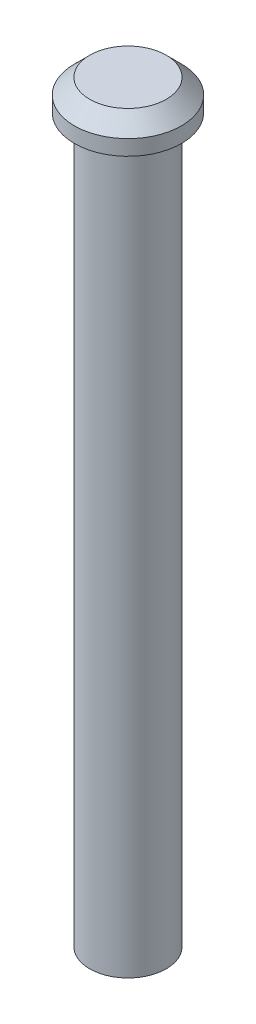
ISO-10303-21;
HEADER;
FILE_DESCRIPTION(('STEP AP214'),'2;1');
FILE_NAME('part.step','',(''),(''),'','','');
FILE_SCHEMA(('AUTOMOTIVE_DESIGN { 1 0 10303 214 1 1 1 1 }'));
ENDSEC;
DATA;
#1=APPLICATION_CONTEXT('core data for automotive mechanical design processes');
#2=APPLICATION_PROTOCOL_DEFINITION('international standard','automotive_design',2000,#1);
#3=PRODUCT_CONTEXT('',#1,'mechanical');
#4=PRODUCT('Part','Part','',(#3));
#5=PRODUCT_RELATED_PRODUCT_CATEGORY('part','',(#4));
#6=PRODUCT_DEFINITION_FORMATION('','',#4);
#7=PRODUCT_DEFINITION_CONTEXT('part definition',#1,'design');
#8=PRODUCT_DEFINITION('design','',#6,#7);
#9=PRODUCT_DEFINITION_SHAPE('','',#8);
#10=(LENGTH_UNIT() NAMED_UNIT(*) SI_UNIT(.MILLI.,.METRE.));
#11=(NAMED_UNIT(*) PLANE_ANGLE_UNIT() SI_UNIT($,.RADIAN.));
#12=(NAMED_UNIT(*) SI_UNIT($,.STERADIAN.) SOLID_ANGLE_UNIT());
#13=UNCERTAINTY_MEASURE_WITH_UNIT(LENGTH_MEASURE(1.E-05),#10,'distance_accuracy_value','');
#14=(GEOMETRIC_REPRESENTATION_CONTEXT(3) GLOBAL_UNCERTAINTY_ASSIGNED_CONTEXT((#13)) GLOBAL_UNIT_ASSIGNED_CONTEXT((#10,
#11,#12)) REPRESENTATION_CONTEXT('',''));
#15=CARTESIAN_POINT('',(0.,0.,0.));
#16=DIRECTION('',(0.,0.,1.));
#17=DIRECTION('',(1.,0.,0.));
#18=AXIS2_PLACEMENT_3D('',#15,#16,#17);
#19=CARTESIAN_POINT('',(0.,47.2,0.));
#20=DIRECTION('',(0.,-1.,0.));
#21=DIRECTION('',(0.,0.,-1.));
#22=AXIS2_PLACEMENT_3D('',#19,#20,#21);
#23=CYLINDRICAL_SURFACE('',#22,2.5);
#24=CARTESIAN_POINT('',(0.,47.2,0.));
#25=DIRECTION('',(0.,1.,0.));
#26=DIRECTION('',(0.,0.,1.));
#27=AXIS2_PLACEMENT_3D('',#24,#25,#26);
#28=CIRCLE('',#27,2.5);
#29=CARTESIAN_POINT('',(0.,47.2,2.5));
#30=VERTEX_POINT('',#29);
#31=EDGE_CURVE('E53',#30,#30,#28,.T.);
#32=ORIENTED_EDGE('',*,*,#31,.F.);
#33=EDGE_LOOP('',(#32));
#34=FACE_BOUND('',#33,.T.);
#35=CARTESIAN_POINT('',(0.,0.,0.));
#36=DIRECTION('',(0.,1.,0.));
#37=DIRECTION('',(0.,0.,1.));
#38=AXIS2_PLACEMENT_3D('',#35,#36,#37);
#39=CIRCLE('',#38,2.5);
#40=CARTESIAN_POINT('',(0.,0.,2.5));
#41=VERTEX_POINT('',#40);
#42=EDGE_CURVE('E58',#41,#41,#39,.T.);
#43=ORIENTED_EDGE('',*,*,#42,.T.);
#44=EDGE_LOOP('',(#43));
#45=FACE_BOUND('',#44,.T.);
#46=ADVANCED_FACE('F39',(#34,#45),#23,.T.);
#47=CARTESIAN_POINT('',(0.,0.,0.));
#48=DIRECTION('',(0.,1.,0.));
#49=DIRECTION('',(0.,0.,1.));
#50=AXIS2_PLACEMENT_3D('',#47,#48,#49);
#51=PLANE('',#50);
#52=CARTESIAN_POINT('',(0.,0.,0.));
#53=DIRECTION('',(0.,-1.,0.));
#54=DIRECTION('',(0.,0.,-1.));
#55=AXIS2_PLACEMENT_3D('',#52,#53,#54);
#56=CIRCLE('',#55,1.5);
#57=CARTESIAN_POINT('',(0.,0.,-1.5));
#58=VERTEX_POINT('',#57);
#59=EDGE_CURVE('E69',#58,#58,#56,.T.);
#60=ORIENTED_EDGE('',*,*,#59,.F.);
#61=EDGE_LOOP('',(#60));
#62=FACE_BOUND('',#61,.T.);
#63=ORIENTED_EDGE('',*,*,#42,.F.);
#64=EDGE_LOOP('',(#63));
#65=FACE_BOUND('',#64,.T.);
#66=ADVANCED_FACE('F85',(#62,#65),#51,.F.);
#67=CARTESIAN_POINT('',(0.,49.2,0.));
#68=DIRECTION('',(0.,-1.,0.));
#69=DIRECTION('',(0.,0.,-1.));
#70=AXIS2_PLACEMENT_3D('',#67,#68,#69);
#71=CYLINDRICAL_SURFACE('',#70,3.5);
#72=CARTESIAN_POINT('',(0.,48.2,0.));
#73=DIRECTION('',(0.,1.,0.));
#74=DIRECTION('',(0.,0.,1.));
#75=AXIS2_PLACEMENT_3D('',#72,#73,#74);
#76=CIRCLE('',#75,3.5);
#77=CARTESIAN_POINT('',(0.,48.2,3.5));
#78=VERTEX_POINT('',#77);
#79=EDGE_CURVE('E10',#78,#78,#76,.F.);
#80=ORIENTED_EDGE('',*,*,#79,.T.);
#81=EDGE_LOOP('',(#80));
#82=FACE_BOUND('',#81,.T.);
#83=CARTESIAN_POINT('',(0.,47.2,0.));
#84=DIRECTION('',(0.,1.,0.));
#85=DIRECTION('',(0.,0.,1.));
#86=AXIS2_PLACEMENT_3D('',#83,#84,#85);
#87=CIRCLE('',#86,3.5);
#88=CARTESIAN_POINT('',(0.,47.2,3.5));
#89=VERTEX_POINT('',#88);
#90=EDGE_CURVE('E63',#89,#89,#87,.T.);
#91=ORIENTED_EDGE('',*,*,#90,.T.);
#92=EDGE_LOOP('',(#91));
#93=FACE_BOUND('',#92,.T.);
#94=ADVANCED_FACE('F88',(#82,#93),#71,.T.);
#95=CARTESIAN_POINT('',(0.,49.2,0.));
#96=DIRECTION('',(0.,1.,0.));
#97=DIRECTION('',(0.,0.,1.));
#98=AXIS2_PLACEMENT_3D('',#95,#96,#97);
#99=PLANE('',#98);
#100=CARTESIAN_POINT('',(0.,49.2,0.));
#101=DIRECTION('',(0.,1.,0.));
#102=DIRECTION('',(0.,0.,1.));
#103=AXIS2_PLACEMENT_3D('',#100,#101,#102);
#104=CIRCLE('',#103,2.49999999999999);
#105=CARTESIAN_POINT('',(0.,49.2,2.49999999999999));
#106=VERTEX_POINT('',#105);
#107=EDGE_CURVE('E48',#106,#106,#104,.T.);
#108=ORIENTED_EDGE('',*,*,#107,.T.);
#109=EDGE_LOOP('',(#108));
#110=FACE_BOUND('',#109,.T.);
#111=ADVANCED_FACE('F100',(#110),#99,.T.);
#112=CARTESIAN_POINT('',(0.,47.2,0.));
#113=DIRECTION('',(0.,1.,0.));
#114=DIRECTION('',(0.,0.,1.));
#115=AXIS2_PLACEMENT_3D('',#112,#113,#114);
#116=PLANE('',#115);
#117=ORIENTED_EDGE('',*,*,#31,.T.);
#118=EDGE_LOOP('',(#117));
#119=FACE_BOUND('',#118,.T.);
#120=ORIENTED_EDGE('',*,*,#90,.F.);
#121=EDGE_LOOP('',(#120));
#122=FACE_BOUND('',#121,.T.);
#123=ADVANCED_FACE('F101',(#119,#122),#116,.F.);
#124=CARTESIAN_POINT('',(0.,49.2,0.));
#125=DIRECTION('',(0.,-1.,0.));
#126=DIRECTION('',(0.,0.,-1.));
#127=AXIS2_PLACEMENT_3D('',#124,#125,#126);
#128=CONICAL_SURFACE('',#127,2.49999999999999,0.78539816339745);
#129=ORIENTED_EDGE('',*,*,#79,.F.);
#130=EDGE_LOOP('',(#129));
#131=FACE_BOUND('',#130,.T.);
#132=ORIENTED_EDGE('',*,*,#107,.F.);
#133=EDGE_LOOP('',(#132));
#134=FACE_BOUND('',#133,.T.);
#135=ADVANCED_FACE('F42',(#131,#134),#128,.T.);
#136=CARTESIAN_POINT('',(0.,5.,0.));
#137=DIRECTION('',(0.,-1.,0.));
#138=DIRECTION('',(0.,0.,-1.));
#139=AXIS2_PLACEMENT_3D('',#136,#137,#138);
#140=CYLINDRICAL_SURFACE('',#139,1.5);
#141=CARTESIAN_POINT('',(0.,5.,0.));
#142=DIRECTION('',(0.,-1.,0.));
#143=DIRECTION('',(0.,0.,-1.));
#144=AXIS2_PLACEMENT_3D('',#141,#142,#143);
#145=CIRCLE('',#144,1.5);
#146=CARTESIAN_POINT('',(0.,5.,-1.5));
#147=VERTEX_POINT('',#146);
#148=EDGE_CURVE('E68',#147,#147,#145,.T.);
#149=ORIENTED_EDGE('',*,*,#148,.F.);
#150=EDGE_LOOP('',(#149));
#151=FACE_BOUND('',#150,.T.);
#152=ORIENTED_EDGE('',*,*,#59,.T.);
#153=EDGE_LOOP('',(#152));
#154=FACE_BOUND('',#153,.T.);
#155=ADVANCED_FACE('F79',(#151,#154),#140,.F.);
#156=CARTESIAN_POINT('',(0.,5.,0.));
#157=DIRECTION('',(0.,-1.,0.));
#158=DIRECTION('',(0.,0.,-1.));
#159=AXIS2_PLACEMENT_3D('',#156,#157,#158);
#160=PLANE('',#159);
#161=ORIENTED_EDGE('',*,*,#148,.T.);
#162=EDGE_LOOP('',(#161));
#163=FACE_BOUND('',#162,.T.);
#164=ADVANCED_FACE('F77',(#163),#160,.T.);
#165=CLOSED_SHELL('',(#46,#66,#94,#111,#123,#135,#155,#164));
#166=MANIFOLD_SOLID_BREP('B2',#165);
#167=ADVANCED_BREP_SHAPE_REPRESENTATION('',(#18,#166),#14);
#168=SHAPE_DEFINITION_REPRESENTATION(#9,#167);
ENDSEC;
END-ISO-10303-21;
